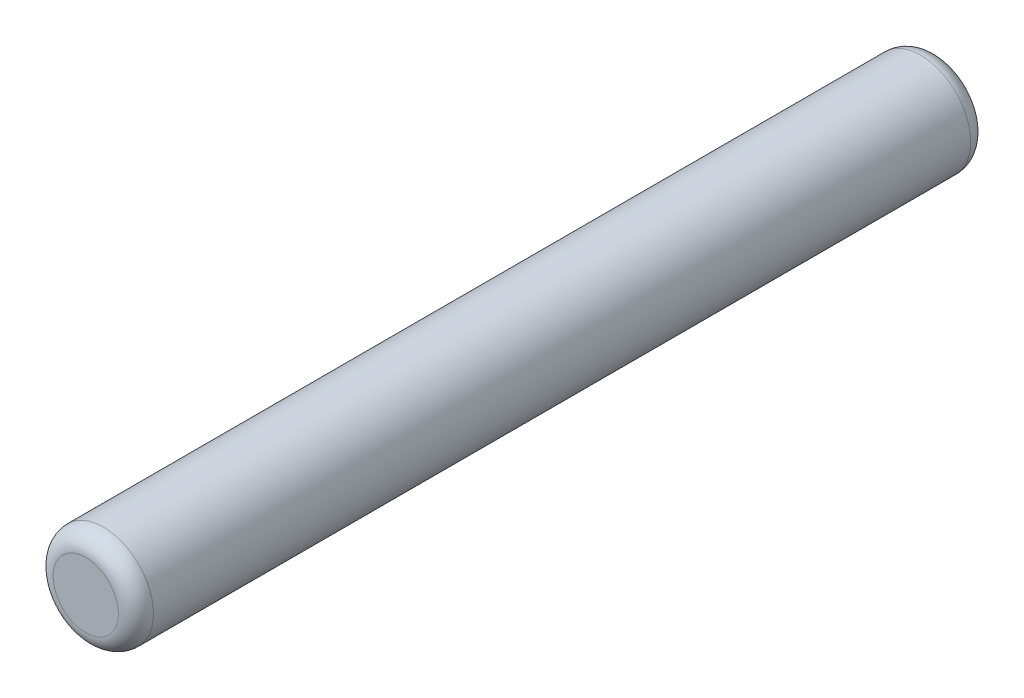
ISO-10303-21;
HEADER;
FILE_DESCRIPTION(('STEP AP214'),'2;1');
FILE_NAME('part.step','',(''),(''),'','','');
FILE_SCHEMA(('AUTOMOTIVE_DESIGN { 1 0 10303 214 1 1 1 1 }'));
ENDSEC;
DATA;
#1=APPLICATION_CONTEXT('core data for automotive mechanical design processes');
#2=APPLICATION_PROTOCOL_DEFINITION('international standard','automotive_design',2000,#1);
#3=PRODUCT_CONTEXT('',#1,'mechanical');
#4=PRODUCT('Part','Part','',(#3));
#5=PRODUCT_RELATED_PRODUCT_CATEGORY('part','',(#4));
#6=PRODUCT_DEFINITION_FORMATION('','',#4);
#7=PRODUCT_DEFINITION_CONTEXT('part definition',#1,'design');
#8=PRODUCT_DEFINITION('design','',#6,#7);
#9=PRODUCT_DEFINITION_SHAPE('','',#8);
#10=(LENGTH_UNIT() NAMED_UNIT(*) SI_UNIT(.MILLI.,.METRE.));
#11=(NAMED_UNIT(*) PLANE_ANGLE_UNIT() SI_UNIT($,.RADIAN.));
#12=(NAMED_UNIT(*) SI_UNIT($,.STERADIAN.) SOLID_ANGLE_UNIT());
#13=UNCERTAINTY_MEASURE_WITH_UNIT(LENGTH_MEASURE(1.E-05),#10,'distance_accuracy_value','');
#14=(GEOMETRIC_REPRESENTATION_CONTEXT(3) GLOBAL_UNCERTAINTY_ASSIGNED_CONTEXT((#13)) GLOBAL_UNIT_ASSIGNED_CONTEXT((#10,
#11,#12)) REPRESENTATION_CONTEXT('',''));
#15=CARTESIAN_POINT('',(0.,0.,0.));
#16=DIRECTION('',(0.,0.,1.));
#17=DIRECTION('',(1.,0.,0.));
#18=AXIS2_PLACEMENT_3D('',#15,#16,#17);
#19=CARTESIAN_POINT('',(0.,0.,8.5));
#20=DIRECTION('',(0.,0.,-1.));
#21=DIRECTION('',(-1.,0.,0.));
#22=AXIS2_PLACEMENT_3D('',#19,#20,#21);
#23=CYLINDRICAL_SURFACE('',#22,1.);
#24=CARTESIAN_POINT('',(0.,0.,-8.15));
#25=DIRECTION('',(0.,0.,1.));
#26=DIRECTION('',(1.,0.,0.));
#27=AXIS2_PLACEMENT_3D('',#24,#25,#26);
#28=CIRCLE('',#27,1.);
#29=CARTESIAN_POINT('',(1.,0.,-8.15));
#30=VERTEX_POINT('',#29);
#31=EDGE_CURVE('E42',#30,#30,#28,.T.);
#32=ORIENTED_EDGE('',*,*,#31,.T.);
#33=EDGE_LOOP('',(#32));
#34=FACE_BOUND('',#33,.T.);
#35=CARTESIAN_POINT('',(0.,0.,8.15));
#36=DIRECTION('',(0.,0.,1.));
#37=DIRECTION('',(1.,0.,0.));
#38=AXIS2_PLACEMENT_3D('',#35,#36,#37);
#39=CIRCLE('',#38,1.);
#40=CARTESIAN_POINT('',(1.,0.,8.15));
#41=VERTEX_POINT('',#40);
#42=EDGE_CURVE('E46',#41,#41,#39,.F.);
#43=ORIENTED_EDGE('',*,*,#42,.T.);
#44=EDGE_LOOP('',(#43));
#45=FACE_BOUND('',#44,.T.);
#46=ADVANCED_FACE('F31',(#34,#45),#23,.T.);
#47=CARTESIAN_POINT('',(0.,0.,8.5));
#48=DIRECTION('',(0.,0.,1.));
#49=DIRECTION('',(1.,0.,0.));
#50=AXIS2_PLACEMENT_3D('',#47,#48,#49);
#51=PLANE('',#50);
#52=CARTESIAN_POINT('',(0.,0.,8.5));
#53=DIRECTION('',(0.,0.,1.));
#54=DIRECTION('',(1.,0.,0.));
#55=AXIS2_PLACEMENT_3D('',#52,#53,#54);
#56=CIRCLE('',#55,0.65);
#57=CARTESIAN_POINT('',(0.65,0.,8.5));
#58=VERTEX_POINT('',#57);
#59=EDGE_CURVE('E10',#58,#58,#56,.T.);
#60=ORIENTED_EDGE('',*,*,#59,.T.);
#61=EDGE_LOOP('',(#60));
#62=FACE_BOUND('',#61,.T.);
#63=ADVANCED_FACE('F62',(#62),#51,.T.);
#64=CARTESIAN_POINT('',(0.,0.,-8.5));
#65=DIRECTION('',(0.,0.,1.));
#66=DIRECTION('',(1.,0.,0.));
#67=AXIS2_PLACEMENT_3D('',#64,#65,#66);
#68=PLANE('',#67);
#69=CARTESIAN_POINT('',(0.,0.,-8.5));
#70=DIRECTION('',(0.,0.,1.));
#71=DIRECTION('',(1.,0.,0.));
#72=AXIS2_PLACEMENT_3D('',#69,#70,#71);
#73=CIRCLE('',#72,0.65);
#74=CARTESIAN_POINT('',(0.65,0.,-8.5));
#75=VERTEX_POINT('',#74);
#76=EDGE_CURVE('E38',#75,#75,#73,.F.);
#77=ORIENTED_EDGE('',*,*,#76,.T.);
#78=EDGE_LOOP('',(#77));
#79=FACE_BOUND('',#78,.T.);
#80=ADVANCED_FACE('F59',(#79),#68,.F.);
#81=CARTESIAN_POINT('',(0.,0.,-8.15));
#82=DIRECTION('',(0.,0.,1.));
#83=DIRECTION('',(1.,0.,0.));
#84=AXIS2_PLACEMENT_3D('',#81,#82,#83);
#85=TOROIDAL_SURFACE('',#84,0.65,0.35);
#86=ORIENTED_EDGE('',*,*,#76,.F.);
#87=EDGE_LOOP('',(#86));
#88=FACE_BOUND('',#87,.T.);
#89=ORIENTED_EDGE('',*,*,#31,.F.);
#90=EDGE_LOOP('',(#89));
#91=FACE_BOUND('',#90,.T.);
#92=ADVANCED_FACE('F55',(#88,#91),#85,.T.);
#93=CARTESIAN_POINT('',(0.,0.,8.15));
#94=DIRECTION('',(0.,0.,1.));
#95=DIRECTION('',(1.,0.,0.));
#96=AXIS2_PLACEMENT_3D('',#93,#94,#95);
#97=TOROIDAL_SURFACE('',#96,0.65,0.35);
#98=ORIENTED_EDGE('',*,*,#42,.F.);
#99=EDGE_LOOP('',(#98));
#100=FACE_BOUND('',#99,.T.);
#101=ORIENTED_EDGE('',*,*,#59,.F.);
#102=EDGE_LOOP('',(#101));
#103=FACE_BOUND('',#102,.T.);
#104=ADVANCED_FACE('F33',(#100,#103),#97,.T.);
#105=CLOSED_SHELL('',(#46,#63,#80,#92,#104));
#106=MANIFOLD_SOLID_BREP('B2',#105);
#107=ADVANCED_BREP_SHAPE_REPRESENTATION('',(#18,#106),#14);
#108=SHAPE_DEFINITION_REPRESENTATION(#9,#107);
ENDSEC;
END-ISO-10303-21;
